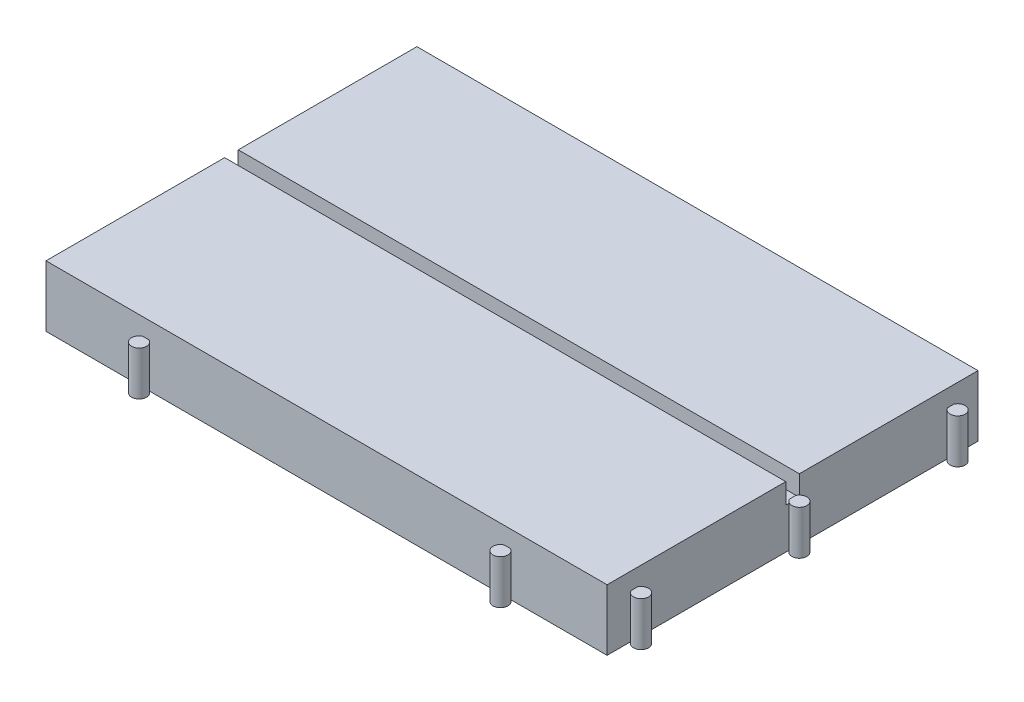
ISO-10303-21;
HEADER;
FILE_DESCRIPTION(('STEP AP214'),'2;1');
FILE_NAME('part.step','',(''),(''),'','','');
FILE_SCHEMA(('AUTOMOTIVE_DESIGN { 1 0 10303 214 1 1 1 1 }'));
ENDSEC;
DATA;
#1=APPLICATION_CONTEXT('core data for automotive mechanical design processes');
#2=APPLICATION_PROTOCOL_DEFINITION('international standard','automotive_design',2000,#1);
#3=PRODUCT_CONTEXT('',#1,'mechanical');
#4=PRODUCT('Part','Part','',(#3));
#5=PRODUCT_RELATED_PRODUCT_CATEGORY('part','',(#4));
#6=PRODUCT_DEFINITION_FORMATION('','',#4);
#7=PRODUCT_DEFINITION_CONTEXT('part definition',#1,'design');
#8=PRODUCT_DEFINITION('design','',#6,#7);
#9=PRODUCT_DEFINITION_SHAPE('','',#8);
#10=(LENGTH_UNIT() NAMED_UNIT(*) SI_UNIT(.MILLI.,.METRE.));
#11=(NAMED_UNIT(*) PLANE_ANGLE_UNIT() SI_UNIT($,.RADIAN.));
#12=(NAMED_UNIT(*) SI_UNIT($,.STERADIAN.) SOLID_ANGLE_UNIT());
#13=UNCERTAINTY_MEASURE_WITH_UNIT(LENGTH_MEASURE(1.E-05),#10,'distance_accuracy_value','');
#14=(GEOMETRIC_REPRESENTATION_CONTEXT(3) GLOBAL_UNCERTAINTY_ASSIGNED_CONTEXT((#13)) GLOBAL_UNIT_ASSIGNED_CONTEXT((#10,
#11,#12)) REPRESENTATION_CONTEXT('',''));
#15=CARTESIAN_POINT('',(0.,0.,0.));
#16=DIRECTION('',(0.,0.,1.));
#17=DIRECTION('',(1.,0.,0.));
#18=AXIS2_PLACEMENT_3D('',#15,#16,#17);
#19=CARTESIAN_POINT('',(0.999999999999982,6.,27.3));
#20=DIRECTION('',(0.,-1.,0.));
#21=DIRECTION('',(0.,0.,-1.));
#22=AXIS2_PLACEMENT_3D('',#19,#20,#21);
#23=PLANE('',#22);
#24=DIRECTION('',(0.,0.,1.));
#25=VECTOR('',#24,1.);
#26=CARTESIAN_POINT('',(0.,6.,27.7582575694956));
#27=LINE('',#26,#25);
#28=CARTESIAN_POINT('',(0.,6.,26.8417424305044));
#29=VERTEX_POINT('',#28);
#30=CARTESIAN_POINT('',(0.,6.,27.7582575694956));
#31=VERTEX_POINT('',#30);
#32=EDGE_CURVE('E220',#29,#31,#27,.T.);
#33=ORIENTED_EDGE('',*,*,#32,.F.);
#34=DIRECTION('',(0.,0.,1.));
#35=VECTOR('',#34,1.);
#36=CARTESIAN_POINT('',(0.,6.,0.));
#37=LINE('',#36,#35);
#38=CARTESIAN_POINT('',(0.,6.,26.3));
#39=VERTEX_POINT('',#38);
#40=EDGE_CURVE('E275',#39,#29,#37,.T.);
#41=ORIENTED_EDGE('',*,*,#40,.F.);
#42=DIRECTION('',(1.,0.,0.));
#43=VECTOR('',#42,1.);
#44=CARTESIAN_POINT('',(0.,6.,26.3));
#45=LINE('',#44,#43);
#46=CARTESIAN_POINT('',(-82.6,6.,26.3));
#47=VERTEX_POINT('',#46);
#48=EDGE_CURVE('E252',#47,#39,#45,.T.);
#49=ORIENTED_EDGE('',*,*,#48,.F.);
#50=DIRECTION('',(0.,0.,-1.));
#51=VECTOR('',#50,1.);
#52=CARTESIAN_POINT('',(-82.6,6.,54.6));
#53=LINE('',#52,#51);
#54=CARTESIAN_POINT('',(-82.6,6.,28.3));
#55=VERTEX_POINT('',#54);
#56=EDGE_CURVE('E273',#55,#47,#53,.T.);
#57=ORIENTED_EDGE('',*,*,#56,.F.);
#58=DIRECTION('',(-1.,0.,0.));
#59=VECTOR('',#58,1.);
#60=CARTESIAN_POINT('',(-82.6,6.,28.3));
#61=LINE('',#60,#59);
#62=CARTESIAN_POINT('',(0.,6.,28.3));
#63=VERTEX_POINT('',#62);
#64=EDGE_CURVE('E234',#63,#55,#61,.T.);
#65=ORIENTED_EDGE('',*,*,#64,.F.);
#66=DIRECTION('',(0.,0.,1.));
#67=VECTOR('',#66,1.);
#68=CARTESIAN_POINT('',(0.,6.,27.7582575694956));
#69=LINE('',#68,#67);
#70=EDGE_CURVE('E279',#31,#63,#69,.T.);
#71=ORIENTED_EDGE('',*,*,#70,.F.);
#72=EDGE_LOOP('',(#33,#41,#49,#57,#65,#71));
#73=FACE_BOUND('',#72,.T.);
#74=ADVANCED_FACE('F33',(#73),#23,.F.);
#75=CARTESIAN_POINT('',(-82.6,6.,54.6));
#76=DIRECTION('',(-1.,0.,0.));
#77=DIRECTION('',(0.,0.,1.));
#78=AXIS2_PLACEMENT_3D('',#75,#76,#77);
#79=PLANE('',#78);
#80=DIRECTION('',(0.,0.,-1.));
#81=VECTOR('',#80,1.);
#82=CARTESIAN_POINT('',(-82.6,0.,54.6));
#83=LINE('',#82,#81);
#84=CARTESIAN_POINT('',(-82.6,0.,54.6));
#85=VERTEX_POINT('',#84);
#86=CARTESIAN_POINT('',(-82.6,0.,0.));
#87=VERTEX_POINT('',#86);
#88=EDGE_CURVE('E272',#85,#87,#83,.T.);
#89=ORIENTED_EDGE('',*,*,#88,.F.);
#90=DIRECTION('',(0.,-1.,0.));
#91=VECTOR('',#90,1.);
#92=CARTESIAN_POINT('',(-82.6,6.,54.6));
#93=LINE('',#92,#91);
#94=CARTESIAN_POINT('',(-82.6,9.,54.6));
#95=VERTEX_POINT('',#94);
#96=EDGE_CURVE('E11',#95,#85,#93,.T.);
#97=ORIENTED_EDGE('',*,*,#96,.F.);
#98=DIRECTION('',(0.,0.,1.));
#99=VECTOR('',#98,1.);
#100=CARTESIAN_POINT('',(-82.6,9.,54.6));
#101=LINE('',#100,#99);
#102=CARTESIAN_POINT('',(-82.6,9.,28.3));
#103=VERTEX_POINT('',#102);
#104=EDGE_CURVE('E240',#103,#95,#101,.T.);
#105=ORIENTED_EDGE('',*,*,#104,.F.);
#106=DIRECTION('',(0.,-1.,0.));
#107=VECTOR('',#106,1.);
#108=CARTESIAN_POINT('',(-82.6,9.,28.3));
#109=LINE('',#108,#107);
#110=EDGE_CURVE('E246',#103,#55,#109,.T.);
#111=ORIENTED_EDGE('',*,*,#110,.T.);
#112=ORIENTED_EDGE('',*,*,#56,.T.);
#113=DIRECTION('',(0.,-1.,0.));
#114=VECTOR('',#113,1.);
#115=CARTESIAN_POINT('',(-82.6,9.,26.3));
#116=LINE('',#115,#114);
#117=CARTESIAN_POINT('',(-82.6,9.,26.3));
#118=VERTEX_POINT('',#117);
#119=EDGE_CURVE('E269',#118,#47,#116,.T.);
#120=ORIENTED_EDGE('',*,*,#119,.F.);
#121=DIRECTION('',(0.,0.,1.));
#122=VECTOR('',#121,1.);
#123=CARTESIAN_POINT('',(-82.6,9.,26.3));
#124=LINE('',#123,#122);
#125=CARTESIAN_POINT('',(-82.6,9.,0.));
#126=VERTEX_POINT('',#125);
#127=EDGE_CURVE('E253',#126,#118,#124,.T.);
#128=ORIENTED_EDGE('',*,*,#127,.F.);
#129=DIRECTION('',(0.,-1.,0.));
#130=VECTOR('',#129,1.);
#131=CARTESIAN_POINT('',(-82.6,6.,0.));
#132=LINE('',#131,#130);
#133=EDGE_CURVE('E37',#126,#87,#132,.T.);
#134=ORIENTED_EDGE('',*,*,#133,.T.);
#135=EDGE_LOOP('',(#89,#97,#105,#111,#112,#120,#128,#134));
#136=FACE_BOUND('',#135,.T.);
#137=ADVANCED_FACE('F35',(#136),#79,.T.);
#138=CARTESIAN_POINT('',(0.,6.,54.6));
#139=DIRECTION('',(0.,0.,1.));
#140=DIRECTION('',(1.,0.,0.));
#141=AXIS2_PLACEMENT_3D('',#138,#139,#140);
#142=PLANE('',#141);
#143=DIRECTION('',(0.,-1.,0.));
#144=VECTOR('',#143,1.);
#145=CARTESIAN_POINT('',(-15.1582575694956,6.5,54.6));
#146=LINE('',#145,#144);
#147=CARTESIAN_POINT('',(-15.1582575694956,6.5,54.6));
#148=VERTEX_POINT('',#147);
#149=CARTESIAN_POINT('',(-15.1582575694956,0.,54.6));
#150=VERTEX_POINT('',#149);
#151=EDGE_CURVE('E168',#148,#150,#146,.T.);
#152=ORIENTED_EDGE('',*,*,#151,.F.);
#153=DIRECTION('',(1.,0.,0.));
#154=VECTOR('',#153,1.);
#155=CARTESIAN_POINT('',(-15.1582575694956,6.5,54.6));
#156=LINE('',#155,#154);
#157=CARTESIAN_POINT('',(-14.2417424305043,6.5,54.6));
#158=VERTEX_POINT('',#157);
#159=EDGE_CURVE('E174',#148,#158,#156,.T.);
#160=ORIENTED_EDGE('',*,*,#159,.T.);
#161=DIRECTION('',(0.,-1.,0.));
#162=VECTOR('',#161,1.);
#163=CARTESIAN_POINT('',(-14.2417424305043,6.5,54.6));
#164=LINE('',#163,#162);
#165=CARTESIAN_POINT('',(-14.2417424305043,0.,54.6));
#166=VERTEX_POINT('',#165);
#167=EDGE_CURVE('E171',#158,#166,#164,.T.);
#168=ORIENTED_EDGE('',*,*,#167,.T.);
#169=DIRECTION('',(-1.,0.,0.));
#170=VECTOR('',#169,1.);
#171=CARTESIAN_POINT('',(0.,0.,54.6));
#172=LINE('',#171,#170);
#173=CARTESIAN_POINT('',(0.,0.,54.6));
#174=VERTEX_POINT('',#173);
#175=EDGE_CURVE('E276',#174,#166,#172,.T.);
#176=ORIENTED_EDGE('',*,*,#175,.F.);
#177=DIRECTION('',(0.,-1.,0.));
#178=VECTOR('',#177,1.);
#179=CARTESIAN_POINT('',(0.,6.,54.6));
#180=LINE('',#179,#178);
#181=CARTESIAN_POINT('',(0.,9.,54.6));
#182=VERTEX_POINT('',#181);
#183=EDGE_CURVE('E42',#182,#174,#180,.T.);
#184=ORIENTED_EDGE('',*,*,#183,.F.);
#185=DIRECTION('',(1.,0.,0.));
#186=VECTOR('',#185,1.);
#187=CARTESIAN_POINT('',(0.,9.,54.6));
#188=LINE('',#187,#186);
#189=EDGE_CURVE('E243',#95,#182,#188,.T.);
#190=ORIENTED_EDGE('',*,*,#189,.F.);
#191=ORIENTED_EDGE('',*,*,#96,.T.);
#192=CARTESIAN_POINT('',(-68.3582575694955,0.,54.6));
#193=VERTEX_POINT('',#192);
#194=EDGE_CURVE('E298',#193,#85,#172,.T.);
#195=ORIENTED_EDGE('',*,*,#194,.F.);
#196=DIRECTION('',(0.,-1.,0.));
#197=VECTOR('',#196,1.);
#198=CARTESIAN_POINT('',(-68.3582575694955,6.5,54.6));
#199=LINE('',#198,#197);
#200=CARTESIAN_POINT('',(-68.3582575694955,6.5,54.6));
#201=VERTEX_POINT('',#200);
#202=EDGE_CURVE('E191',#201,#193,#199,.T.);
#203=ORIENTED_EDGE('',*,*,#202,.F.);
#204=DIRECTION('',(1.,0.,0.));
#205=VECTOR('',#204,1.);
#206=CARTESIAN_POINT('',(-68.3582575694955,6.5,54.6));
#207=LINE('',#206,#205);
#208=CARTESIAN_POINT('',(-67.4417424305045,6.5,54.6));
#209=VERTEX_POINT('',#208);
#210=EDGE_CURVE('E188',#201,#209,#207,.T.);
#211=ORIENTED_EDGE('',*,*,#210,.T.);
#212=DIRECTION('',(0.,-1.,0.));
#213=VECTOR('',#212,1.);
#214=CARTESIAN_POINT('',(-67.4417424305045,6.5,54.6));
#215=LINE('',#214,#213);
#216=CARTESIAN_POINT('',(-67.4417424305045,0.,54.6));
#217=VERTEX_POINT('',#216);
#218=EDGE_CURVE('E193',#209,#217,#215,.T.);
#219=ORIENTED_EDGE('',*,*,#218,.T.);
#220=EDGE_CURVE('E181',#150,#217,#172,.T.);
#221=ORIENTED_EDGE('',*,*,#220,.F.);
#222=EDGE_LOOP('',(#152,#160,#168,#176,#184,#190,#191,#195,#203,#211,#219,#221));
#223=FACE_BOUND('',#222,.T.);
#224=ADVANCED_FACE('F179',(#223),#142,.T.);
#225=CARTESIAN_POINT('',(0.,6.,27.7582575694956));
#226=DIRECTION('',(1.,0.,0.));
#227=DIRECTION('',(0.,0.,-1.));
#228=AXIS2_PLACEMENT_3D('',#225,#226,#227);
#229=PLANE('',#228);
#230=DIRECTION('',(0.,-1.,0.));
#231=VECTOR('',#230,1.);
#232=CARTESIAN_POINT('',(0.,6.5,51.058257509891));
#233=LINE('',#232,#231);
#234=CARTESIAN_POINT('',(0.,6.5,51.058257509891));
#235=VERTEX_POINT('',#234);
#236=CARTESIAN_POINT('',(0.,0.,51.058257509891));
#237=VERTEX_POINT('',#236);
#238=EDGE_CURVE('E202',#235,#237,#233,.T.);
#239=ORIENTED_EDGE('',*,*,#238,.F.);
#240=DIRECTION('',(0.,0.,-1.));
#241=VECTOR('',#240,1.);
#242=CARTESIAN_POINT('',(0.,6.5,51.058257509891));
#243=LINE('',#242,#241);
#244=CARTESIAN_POINT('',(0.,6.5,50.1417423708998));
#245=VERTEX_POINT('',#244);
#246=EDGE_CURVE('E199',#235,#245,#243,.T.);
#247=ORIENTED_EDGE('',*,*,#246,.T.);
#248=DIRECTION('',(0.,-1.,0.));
#249=VECTOR('',#248,1.);
#250=CARTESIAN_POINT('',(0.,6.5,50.1417423708998));
#251=LINE('',#250,#249);
#252=CARTESIAN_POINT('',(0.,0.,50.1417423708998));
#253=VERTEX_POINT('',#252);
#254=EDGE_CURVE('E204',#245,#253,#251,.T.);
#255=ORIENTED_EDGE('',*,*,#254,.T.);
#256=DIRECTION('',(0.,0.,1.));
#257=VECTOR('',#256,1.);
#258=CARTESIAN_POINT('',(0.,0.,27.7582575694956));
#259=LINE('',#258,#257);
#260=CARTESIAN_POINT('',(0.,0.,27.7582575694956));
#261=VERTEX_POINT('',#260);
#262=EDGE_CURVE('E295',#261,#253,#259,.T.);
#263=ORIENTED_EDGE('',*,*,#262,.F.);
#264=DIRECTION('',(0.,-1.,0.));
#265=VECTOR('',#264,1.);
#266=CARTESIAN_POINT('',(0.,6.,27.7582575694956));
#267=LINE('',#266,#265);
#268=EDGE_CURVE('E302',#31,#261,#267,.T.);
#269=ORIENTED_EDGE('',*,*,#268,.F.);
#270=ORIENTED_EDGE('',*,*,#70,.T.);
#271=DIRECTION('',(0.,-1.,0.));
#272=VECTOR('',#271,1.);
#273=CARTESIAN_POINT('',(0.,9.,28.3));
#274=LINE('',#273,#272);
#275=CARTESIAN_POINT('',(0.,9.,28.3));
#276=VERTEX_POINT('',#275);
#277=EDGE_CURVE('E250',#276,#63,#274,.T.);
#278=ORIENTED_EDGE('',*,*,#277,.F.);
#279=DIRECTION('',(0.,0.,-1.));
#280=VECTOR('',#279,1.);
#281=CARTESIAN_POINT('',(0.,9.,28.3));
#282=LINE('',#281,#280);
#283=EDGE_CURVE('E235',#182,#276,#282,.T.);
#284=ORIENTED_EDGE('',*,*,#283,.F.);
#285=ORIENTED_EDGE('',*,*,#183,.T.);
#286=EDGE_CURVE('E294',#237,#174,#259,.T.);
#287=ORIENTED_EDGE('',*,*,#286,.F.);
#288=EDGE_LOOP('',(#239,#247,#255,#263,#269,#270,#278,#284,#285,#287));
#289=FACE_BOUND('',#288,.T.);
#290=ADVANCED_FACE('F357',(#289),#229,.T.);
#291=CARTESIAN_POINT('',(0.999999999999982,6.,27.3));
#292=DIRECTION('',(0.,-1.,0.));
#293=DIRECTION('',(0.,0.,-1.));
#294=AXIS2_PLACEMENT_3D('',#291,#292,#293);
#295=CYLINDRICAL_SURFACE('',#294,1.09999999999998);
#296=CARTESIAN_POINT('',(0.999999999999982,0.,27.3));
#297=DIRECTION('',(0.,-1.,0.));
#298=DIRECTION('',(0.,0.,-1.));
#299=AXIS2_PLACEMENT_3D('',#296,#297,#298);
#300=CIRCLE('',#299,1.09999999999998);
#301=CARTESIAN_POINT('',(0.,0.,26.8417424305044));
#302=VERTEX_POINT('',#301);
#303=EDGE_CURVE('E291',#302,#261,#300,.T.);
#304=ORIENTED_EDGE('',*,*,#303,.F.);
#305=DIRECTION('',(0.,-1.,0.));
#306=VECTOR('',#305,1.);
#307=CARTESIAN_POINT('',(0.,6.,26.8417424305044));
#308=LINE('',#307,#306);
#309=EDGE_CURVE('E304',#29,#302,#308,.T.);
#310=ORIENTED_EDGE('',*,*,#309,.F.);
#311=DIRECTION('',(0.,-1.,0.));
#312=VECTOR('',#311,1.);
#313=CARTESIAN_POINT('',(0.,6.5,26.8417424305044));
#314=LINE('',#313,#312);
#315=CARTESIAN_POINT('',(0.,6.5,26.8417424305044));
#316=VERTEX_POINT('',#315);
#317=EDGE_CURVE('E232',#316,#29,#314,.T.);
#318=ORIENTED_EDGE('',*,*,#317,.F.);
#319=CARTESIAN_POINT('',(0.999999999999982,6.5,27.3));
#320=DIRECTION('',(0.,1.,0.));
#321=DIRECTION('',(0.,0.,-1.));
#322=AXIS2_PLACEMENT_3D('',#319,#320,#321);
#323=CIRCLE('',#322,1.09999999999998);
#324=CARTESIAN_POINT('',(0.,6.5,27.7582575694956));
#325=VERTEX_POINT('',#324);
#326=EDGE_CURVE('E223',#325,#316,#323,.T.);
#327=ORIENTED_EDGE('',*,*,#326,.F.);
#328=DIRECTION('',(0.,-1.,0.));
#329=VECTOR('',#328,1.);
#330=CARTESIAN_POINT('',(0.,6.5,27.7582575694956));
#331=LINE('',#330,#329);
#332=EDGE_CURVE('E228',#325,#31,#331,.T.);
#333=ORIENTED_EDGE('',*,*,#332,.T.);
#334=ORIENTED_EDGE('',*,*,#268,.T.);
#335=EDGE_LOOP('',(#304,#310,#318,#327,#333,#334));
#336=FACE_BOUND('',#335,.T.);
#337=ADVANCED_FACE('F352',(#336),#295,.T.);
#338=CARTESIAN_POINT('',(0.,6.,0.));
#339=DIRECTION('',(1.,0.,0.));
#340=DIRECTION('',(0.,0.,-1.));
#341=AXIS2_PLACEMENT_3D('',#338,#339,#340);
#342=PLANE('',#341);
#343=DIRECTION('',(0.,-1.,0.));
#344=VECTOR('',#343,1.);
#345=CARTESIAN_POINT('',(0.,6.5,4.45825762910023));
#346=LINE('',#345,#344);
#347=CARTESIAN_POINT('',(0.,6.5,4.45825762910023));
#348=VERTEX_POINT('',#347);
#349=CARTESIAN_POINT('',(0.,0.,4.45825762910023));
#350=VERTEX_POINT('',#349);
#351=EDGE_CURVE('E215',#348,#350,#346,.T.);
#352=ORIENTED_EDGE('',*,*,#351,.F.);
#353=DIRECTION('',(0.,0.,-1.));
#354=VECTOR('',#353,1.);
#355=CARTESIAN_POINT('',(0.,6.5,4.45825762910023));
#356=LINE('',#355,#354);
#357=CARTESIAN_POINT('',(0.,6.5,3.54174249010905));
#358=VERTEX_POINT('',#357);
#359=EDGE_CURVE('E212',#348,#358,#356,.T.);
#360=ORIENTED_EDGE('',*,*,#359,.T.);
#361=DIRECTION('',(0.,-1.,0.));
#362=VECTOR('',#361,1.);
#363=CARTESIAN_POINT('',(0.,6.5,3.54174249010905));
#364=LINE('',#363,#362);
#365=CARTESIAN_POINT('',(0.,0.,3.54174249010905));
#366=VERTEX_POINT('',#365);
#367=EDGE_CURVE('E217',#358,#366,#364,.T.);
#368=ORIENTED_EDGE('',*,*,#367,.T.);
#369=DIRECTION('',(0.,0.,1.));
#370=VECTOR('',#369,1.);
#371=CARTESIAN_POINT('',(0.,0.,0.));
#372=LINE('',#371,#370);
#373=CARTESIAN_POINT('',(0.,0.,0.));
#374=VERTEX_POINT('',#373);
#375=EDGE_CURVE('E288',#374,#366,#372,.T.);
#376=ORIENTED_EDGE('',*,*,#375,.F.);
#377=DIRECTION('',(0.,-1.,0.));
#378=VECTOR('',#377,1.);
#379=CARTESIAN_POINT('',(0.,6.,0.));
#380=LINE('',#379,#378);
#381=CARTESIAN_POINT('',(0.,9.,0.));
#382=VERTEX_POINT('',#381);
#383=EDGE_CURVE('E306',#382,#374,#380,.T.);
#384=ORIENTED_EDGE('',*,*,#383,.F.);
#385=DIRECTION('',(0.,0.,-1.));
#386=VECTOR('',#385,1.);
#387=CARTESIAN_POINT('',(0.,9.,0.));
#388=LINE('',#387,#386);
#389=CARTESIAN_POINT('',(0.,9.,26.3));
#390=VERTEX_POINT('',#389);
#391=EDGE_CURVE('E258',#390,#382,#388,.T.);
#392=ORIENTED_EDGE('',*,*,#391,.F.);
#393=DIRECTION('',(0.,-1.,0.));
#394=VECTOR('',#393,1.);
#395=CARTESIAN_POINT('',(0.,9.,26.3));
#396=LINE('',#395,#394);
#397=EDGE_CURVE('E264',#390,#39,#396,.T.);
#398=ORIENTED_EDGE('',*,*,#397,.T.);
#399=ORIENTED_EDGE('',*,*,#40,.T.);
#400=ORIENTED_EDGE('',*,*,#309,.T.);
#401=EDGE_CURVE('E287',#350,#302,#372,.T.);
#402=ORIENTED_EDGE('',*,*,#401,.F.);
#403=EDGE_LOOP('',(#352,#360,#368,#376,#384,#392,#398,#399,#400,#402));
#404=FACE_BOUND('',#403,.T.);
#405=ADVANCED_FACE('F342',(#404),#342,.T.);
#406=CARTESIAN_POINT('',(-82.6,6.,0.));
#407=DIRECTION('',(0.,0.,-1.));
#408=DIRECTION('',(-1.,0.,0.));
#409=AXIS2_PLACEMENT_3D('',#406,#407,#408);
#410=PLANE('',#409);
#411=DIRECTION('',(1.,0.,0.));
#412=VECTOR('',#411,1.);
#413=CARTESIAN_POINT('',(-82.6,0.,0.));
#414=LINE('',#413,#412);
#415=EDGE_CURVE('E284',#87,#374,#414,.T.);
#416=ORIENTED_EDGE('',*,*,#415,.F.);
#417=ORIENTED_EDGE('',*,*,#133,.F.);
#418=DIRECTION('',(-1.,0.,0.));
#419=VECTOR('',#418,1.);
#420=CARTESIAN_POINT('',(-82.6,9.,0.));
#421=LINE('',#420,#419);
#422=EDGE_CURVE('E261',#382,#126,#421,.T.);
#423=ORIENTED_EDGE('',*,*,#422,.F.);
#424=ORIENTED_EDGE('',*,*,#383,.T.);
#425=EDGE_LOOP('',(#416,#417,#423,#424));
#426=FACE_BOUND('',#425,.T.);
#427=ADVANCED_FACE('F315',(#426),#410,.T.);
#428=CARTESIAN_POINT('',(0.999999999999982,0.,27.3));
#429=DIRECTION('',(0.,-1.,0.));
#430=DIRECTION('',(0.,0.,-1.));
#431=AXIS2_PLACEMENT_3D('',#428,#429,#430);
#432=PLANE('',#431);
#433=ORIENTED_EDGE('',*,*,#88,.T.);
#434=ORIENTED_EDGE('',*,*,#415,.T.);
#435=ORIENTED_EDGE('',*,*,#375,.T.);
#436=CARTESIAN_POINT('',(1.,0.,4.00000005960464));
#437=DIRECTION('',(0.,-1.,0.));
#438=DIRECTION('',(0.,0.,-1.));
#439=AXIS2_PLACEMENT_3D('',#436,#437,#438);
#440=CIRCLE('',#439,1.10000000000001);
#441=EDGE_CURVE('E207',#366,#350,#440,.T.);
#442=ORIENTED_EDGE('',*,*,#441,.T.);
#443=ORIENTED_EDGE('',*,*,#401,.T.);
#444=ORIENTED_EDGE('',*,*,#303,.T.);
#445=ORIENTED_EDGE('',*,*,#262,.T.);
#446=CARTESIAN_POINT('',(0.999999999999977,0.,50.5999999403954));
#447=DIRECTION('',(0.,-1.,0.));
#448=DIRECTION('',(0.,0.,-1.));
#449=AXIS2_PLACEMENT_3D('',#446,#447,#448);
#450=CIRCLE('',#449,1.09999999999998);
#451=EDGE_CURVE('E195',#253,#237,#450,.T.);
#452=ORIENTED_EDGE('',*,*,#451,.T.);
#453=ORIENTED_EDGE('',*,*,#286,.T.);
#454=ORIENTED_EDGE('',*,*,#175,.T.);
#455=CARTESIAN_POINT('',(-14.6999999999999,0.,55.6));
#456=DIRECTION('',(0.,-1.,0.));
#457=DIRECTION('',(0.,0.,-1.));
#458=AXIS2_PLACEMENT_3D('',#455,#456,#457);
#459=CIRCLE('',#458,1.1);
#460=EDGE_CURVE('E50',#166,#150,#459,.T.);
#461=ORIENTED_EDGE('',*,*,#460,.T.);
#462=ORIENTED_EDGE('',*,*,#220,.T.);
#463=CARTESIAN_POINT('',(-67.9,0.,55.6000000000001));
#464=DIRECTION('',(0.,-1.,0.));
#465=DIRECTION('',(0.,0.,-1.));
#466=AXIS2_PLACEMENT_3D('',#463,#464,#465);
#467=CIRCLE('',#466,1.10000000000004);
#468=EDGE_CURVE('E56',#217,#193,#467,.T.);
#469=ORIENTED_EDGE('',*,*,#468,.T.);
#470=ORIENTED_EDGE('',*,*,#194,.T.);
#471=EDGE_LOOP('',(#433,#434,#435,#442,#443,#444,#445,#452,#453,#454,#461,#462,#469,#470));
#472=FACE_BOUND('',#471,.T.);
#473=ADVANCED_FACE('F316',(#472),#432,.T.);
#474=CARTESIAN_POINT('',(0.,9.,26.3));
#475=DIRECTION('',(0.,0.,-1.));
#476=DIRECTION('',(-1.,0.,0.));
#477=AXIS2_PLACEMENT_3D('',#474,#475,#476);
#478=PLANE('',#477);
#479=ORIENTED_EDGE('',*,*,#48,.T.);
#480=ORIENTED_EDGE('',*,*,#397,.F.);
#481=DIRECTION('',(1.,0.,0.));
#482=VECTOR('',#481,1.);
#483=CARTESIAN_POINT('',(0.,9.,26.3));
#484=LINE('',#483,#482);
#485=EDGE_CURVE('E256',#118,#390,#484,.T.);
#486=ORIENTED_EDGE('',*,*,#485,.F.);
#487=ORIENTED_EDGE('',*,*,#119,.T.);
#488=EDGE_LOOP('',(#479,#480,#486,#487));
#489=FACE_BOUND('',#488,.T.);
#490=ADVANCED_FACE('F336',(#489),#478,.F.);
#491=CARTESIAN_POINT('',(0.,9.,0.));
#492=DIRECTION('',(0.,-1.,0.));
#493=DIRECTION('',(0.,0.,-1.));
#494=AXIS2_PLACEMENT_3D('',#491,#492,#493);
#495=PLANE('',#494);
#496=ORIENTED_EDGE('',*,*,#127,.T.);
#497=ORIENTED_EDGE('',*,*,#485,.T.);
#498=ORIENTED_EDGE('',*,*,#391,.T.);
#499=ORIENTED_EDGE('',*,*,#422,.T.);
#500=EDGE_LOOP('',(#496,#497,#498,#499));
#501=FACE_BOUND('',#500,.T.);
#502=ADVANCED_FACE('F339',(#501),#495,.F.);
#503=CARTESIAN_POINT('',(-82.6,9.,28.3));
#504=DIRECTION('',(0.,0.,1.));
#505=DIRECTION('',(1.,0.,0.));
#506=AXIS2_PLACEMENT_3D('',#503,#504,#505);
#507=PLANE('',#506);
#508=ORIENTED_EDGE('',*,*,#64,.T.);
#509=ORIENTED_EDGE('',*,*,#110,.F.);
#510=DIRECTION('',(-1.,0.,0.));
#511=VECTOR('',#510,1.);
#512=CARTESIAN_POINT('',(-82.6,9.,28.3));
#513=LINE('',#512,#511);
#514=EDGE_CURVE('E238',#276,#103,#513,.T.);
#515=ORIENTED_EDGE('',*,*,#514,.F.);
#516=ORIENTED_EDGE('',*,*,#277,.T.);
#517=EDGE_LOOP('',(#508,#509,#515,#516));
#518=FACE_BOUND('',#517,.T.);
#519=ADVANCED_FACE('F327',(#518),#507,.F.);
#520=CARTESIAN_POINT('',(0.,9.,0.));
#521=DIRECTION('',(0.,-1.,0.));
#522=DIRECTION('',(0.,0.,-1.));
#523=AXIS2_PLACEMENT_3D('',#520,#521,#522);
#524=PLANE('',#523);
#525=ORIENTED_EDGE('',*,*,#283,.T.);
#526=ORIENTED_EDGE('',*,*,#514,.T.);
#527=ORIENTED_EDGE('',*,*,#104,.T.);
#528=ORIENTED_EDGE('',*,*,#189,.T.);
#529=EDGE_LOOP('',(#525,#526,#527,#528));
#530=FACE_BOUND('',#529,.T.);
#531=ADVANCED_FACE('F322',(#530),#524,.F.);
#532=CARTESIAN_POINT('',(0.,6.5,27.7582575694956));
#533=DIRECTION('',(1.,0.,0.));
#534=DIRECTION('',(0.,0.,-1.));
#535=AXIS2_PLACEMENT_3D('',#532,#533,#534);
#536=PLANE('',#535);
#537=ORIENTED_EDGE('',*,*,#32,.T.);
#538=ORIENTED_EDGE('',*,*,#332,.F.);
#539=DIRECTION('',(0.,0.,1.));
#540=VECTOR('',#539,1.);
#541=CARTESIAN_POINT('',(0.,6.5,27.7582575694956));
#542=LINE('',#541,#540);
#543=EDGE_CURVE('E226',#316,#325,#542,.T.);
#544=ORIENTED_EDGE('',*,*,#543,.F.);
#545=ORIENTED_EDGE('',*,*,#317,.T.);
#546=EDGE_LOOP('',(#537,#538,#544,#545));
#547=FACE_BOUND('',#546,.T.);
#548=ADVANCED_FACE('F368',(#547),#536,.F.);
#549=CARTESIAN_POINT('',(0.999999999999982,6.5,27.3));
#550=DIRECTION('',(0.,-1.,0.));
#551=DIRECTION('',(0.,0.,-1.));
#552=AXIS2_PLACEMENT_3D('',#549,#550,#551);
#553=PLANE('',#552);
#554=ORIENTED_EDGE('',*,*,#326,.T.);
#555=ORIENTED_EDGE('',*,*,#543,.T.);
#556=EDGE_LOOP('',(#554,#555));
#557=FACE_BOUND('',#556,.T.);
#558=ADVANCED_FACE('F371',(#557),#553,.F.);
#559=CARTESIAN_POINT('',(1.,6.5,4.00000005960464));
#560=DIRECTION('',(0.,-1.,0.));
#561=DIRECTION('',(0.,0.,-1.));
#562=AXIS2_PLACEMENT_3D('',#559,#560,#561);
#563=CYLINDRICAL_SURFACE('',#562,1.10000000000001);
#564=ORIENTED_EDGE('',*,*,#441,.F.);
#565=ORIENTED_EDGE('',*,*,#367,.F.);
#566=CARTESIAN_POINT('',(1.,6.5,4.00000005960464));
#567=DIRECTION('',(0.,-1.,0.));
#568=DIRECTION('',(0.,0.,-1.));
#569=AXIS2_PLACEMENT_3D('',#566,#567,#568);
#570=CIRCLE('',#569,1.10000000000001);
#571=EDGE_CURVE('E210',#358,#348,#570,.T.);
#572=ORIENTED_EDGE('',*,*,#571,.T.);
#573=ORIENTED_EDGE('',*,*,#351,.T.);
#574=EDGE_LOOP('',(#564,#565,#572,#573));
#575=FACE_BOUND('',#574,.T.);
#576=ADVANCED_FACE('F345',(#575),#563,.T.);
#577=CARTESIAN_POINT('',(1.,6.5,4.00000005960464));
#578=DIRECTION('',(0.,-1.,0.));
#579=DIRECTION('',(0.,0.,-1.));
#580=AXIS2_PLACEMENT_3D('',#577,#578,#579);
#581=PLANE('',#580);
#582=ORIENTED_EDGE('',*,*,#571,.F.);
#583=ORIENTED_EDGE('',*,*,#359,.F.);
#584=EDGE_LOOP('',(#582,#583));
#585=FACE_BOUND('',#584,.T.);
#586=ADVANCED_FACE('F378',(#585),#581,.F.);
#587=CARTESIAN_POINT('',(0.999999999999977,6.5,50.5999999403954));
#588=DIRECTION('',(0.,-1.,0.));
#589=DIRECTION('',(0.,0.,-1.));
#590=AXIS2_PLACEMENT_3D('',#587,#588,#589);
#591=CYLINDRICAL_SURFACE('',#590,1.09999999999998);
#592=ORIENTED_EDGE('',*,*,#451,.F.);
#593=ORIENTED_EDGE('',*,*,#254,.F.);
#594=CARTESIAN_POINT('',(0.999999999999977,6.5,50.5999999403954));
#595=DIRECTION('',(0.,-1.,0.));
#596=DIRECTION('',(0.,0.,-1.));
#597=AXIS2_PLACEMENT_3D('',#594,#595,#596);
#598=CIRCLE('',#597,1.09999999999998);
#599=EDGE_CURVE('E197',#245,#235,#598,.T.);
#600=ORIENTED_EDGE('',*,*,#599,.T.);
#601=ORIENTED_EDGE('',*,*,#238,.T.);
#602=EDGE_LOOP('',(#592,#593,#600,#601));
#603=FACE_BOUND('',#602,.T.);
#604=ADVANCED_FACE('F361',(#603),#591,.T.);
#605=CARTESIAN_POINT('',(0.999999999999977,6.5,50.5999999403954));
#606=DIRECTION('',(0.,-1.,0.));
#607=DIRECTION('',(0.,0.,-1.));
#608=AXIS2_PLACEMENT_3D('',#605,#606,#607);
#609=PLANE('',#608);
#610=ORIENTED_EDGE('',*,*,#599,.F.);
#611=ORIENTED_EDGE('',*,*,#246,.F.);
#612=EDGE_LOOP('',(#610,#611));
#613=FACE_BOUND('',#612,.T.);
#614=ADVANCED_FACE('F363',(#613),#609,.F.);
#615=CARTESIAN_POINT('',(-67.9,6.5,55.6000000000001));
#616=DIRECTION('',(0.,-1.,0.));
#617=DIRECTION('',(0.,0.,-1.));
#618=AXIS2_PLACEMENT_3D('',#615,#616,#617);
#619=CYLINDRICAL_SURFACE('',#618,1.10000000000004);
#620=ORIENTED_EDGE('',*,*,#468,.F.);
#621=ORIENTED_EDGE('',*,*,#218,.F.);
#622=CARTESIAN_POINT('',(-67.9,6.5,55.6000000000001));
#623=DIRECTION('',(0.,-1.,0.));
#624=DIRECTION('',(0.,0.,-1.));
#625=AXIS2_PLACEMENT_3D('',#622,#623,#624);
#626=CIRCLE('',#625,1.10000000000004);
#627=EDGE_CURVE('E186',#209,#201,#626,.T.);
#628=ORIENTED_EDGE('',*,*,#627,.T.);
#629=ORIENTED_EDGE('',*,*,#202,.T.);
#630=EDGE_LOOP('',(#620,#621,#628,#629));
#631=FACE_BOUND('',#630,.T.);
#632=ADVANCED_FACE('F491',(#631),#619,.T.);
#633=CARTESIAN_POINT('',(-67.9,6.5,55.6000000000001));
#634=DIRECTION('',(0.,-1.,0.));
#635=DIRECTION('',(0.,0.,-1.));
#636=AXIS2_PLACEMENT_3D('',#633,#634,#635);
#637=PLANE('',#636);
#638=ORIENTED_EDGE('',*,*,#627,.F.);
#639=ORIENTED_EDGE('',*,*,#210,.F.);
#640=EDGE_LOOP('',(#638,#639));
#641=FACE_BOUND('',#640,.T.);
#642=ADVANCED_FACE('F501',(#641),#637,.F.);
#643=CARTESIAN_POINT('',(-14.6999999999999,6.5,55.6));
#644=DIRECTION('',(0.,-1.,0.));
#645=DIRECTION('',(0.,0.,-1.));
#646=AXIS2_PLACEMENT_3D('',#643,#644,#645);
#647=CYLINDRICAL_SURFACE('',#646,1.1);
#648=ORIENTED_EDGE('',*,*,#460,.F.);
#649=ORIENTED_EDGE('',*,*,#167,.F.);
#650=CARTESIAN_POINT('',(-14.6999999999999,6.5,55.6));
#651=DIRECTION('',(0.,-1.,0.));
#652=DIRECTION('',(0.,0.,-1.));
#653=AXIS2_PLACEMENT_3D('',#650,#651,#652);
#654=CIRCLE('',#653,1.1);
#655=EDGE_CURVE('E164',#158,#148,#654,.T.);
#656=ORIENTED_EDGE('',*,*,#655,.T.);
#657=ORIENTED_EDGE('',*,*,#151,.T.);
#658=EDGE_LOOP('',(#648,#649,#656,#657));
#659=FACE_BOUND('',#658,.T.);
#660=ADVANCED_FACE('F166',(#659),#647,.T.);
#661=CARTESIAN_POINT('',(-14.6999999999999,6.5,55.6));
#662=DIRECTION('',(0.,-1.,0.));
#663=DIRECTION('',(0.,0.,-1.));
#664=AXIS2_PLACEMENT_3D('',#661,#662,#663);
#665=PLANE('',#664);
#666=ORIENTED_EDGE('',*,*,#655,.F.);
#667=ORIENTED_EDGE('',*,*,#159,.F.);
#668=EDGE_LOOP('',(#666,#667));
#669=FACE_BOUND('',#668,.T.);
#670=ADVANCED_FACE('F176',(#669),#665,.F.);
#671=CLOSED_SHELL('',(#74,#137,#224,#290,#337,#405,#427,#473,#490,#502,#519,#531,#548,#558,#576,
#586,#604,#614,#632,#642,#660,#670));
#672=MANIFOLD_SOLID_BREP('B2',#671);
#673=ADVANCED_BREP_SHAPE_REPRESENTATION('',(#18,#672),#14);
#674=SHAPE_DEFINITION_REPRESENTATION(#9,#673);
ENDSEC;
END-ISO-10303-21;
